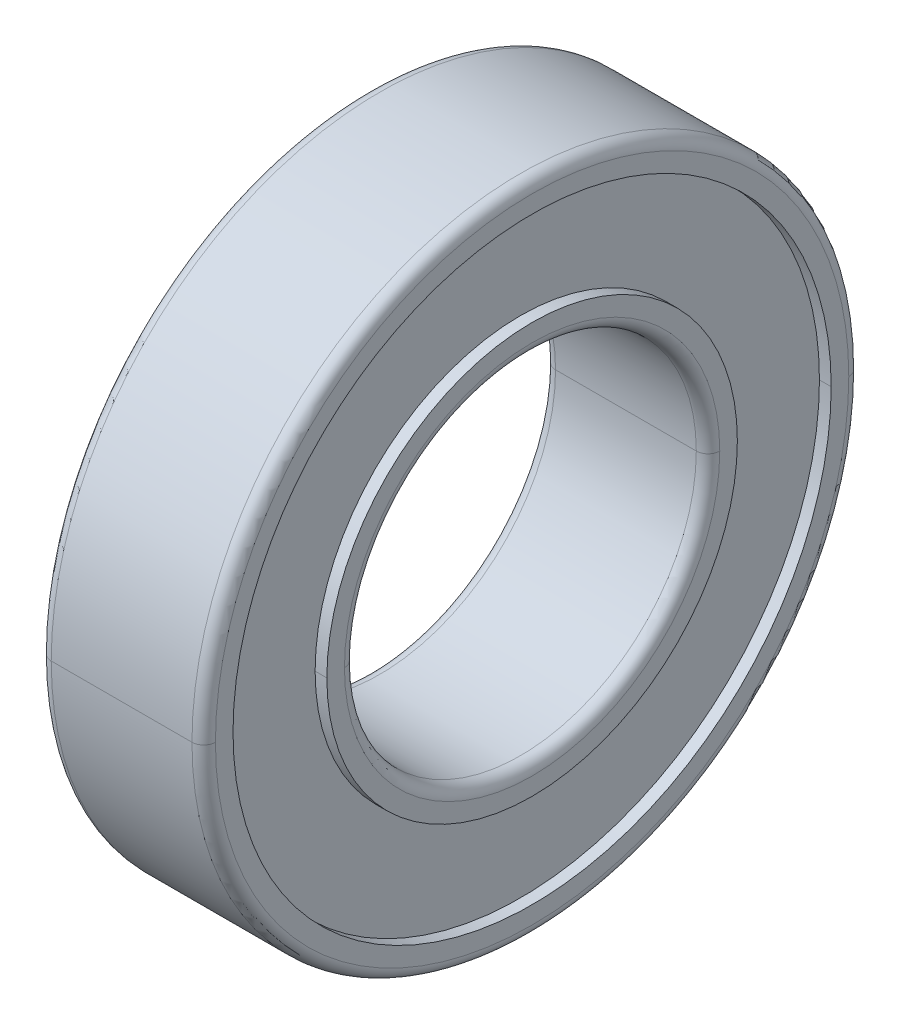
ISO-10303-21;
HEADER;
FILE_DESCRIPTION(('STEP AP214'),'2;1');
FILE_NAME('part.step','',(''),(''),'','','');
FILE_SCHEMA(('AUTOMOTIVE_DESIGN { 1 0 10303 214 1 1 1 1 }'));
ENDSEC;
DATA;
#1=APPLICATION_CONTEXT('core data for automotive mechanical design processes');
#2=APPLICATION_PROTOCOL_DEFINITION('international standard','automotive_design',2000,#1);
#3=PRODUCT_CONTEXT('',#1,'mechanical');
#4=PRODUCT('Part','Part','',(#3));
#5=PRODUCT_RELATED_PRODUCT_CATEGORY('part','',(#4));
#6=PRODUCT_DEFINITION_FORMATION('','',#4);
#7=PRODUCT_DEFINITION_CONTEXT('part definition',#1,'design');
#8=PRODUCT_DEFINITION('design','',#6,#7);
#9=PRODUCT_DEFINITION_SHAPE('','',#8);
#10=(LENGTH_UNIT() NAMED_UNIT(*) SI_UNIT(.MILLI.,.METRE.));
#11=(NAMED_UNIT(*) PLANE_ANGLE_UNIT() SI_UNIT($,.RADIAN.));
#12=(NAMED_UNIT(*) SI_UNIT($,.STERADIAN.) SOLID_ANGLE_UNIT());
#13=UNCERTAINTY_MEASURE_WITH_UNIT(LENGTH_MEASURE(1.E-05),#10,'distance_accuracy_value','');
#14=(GEOMETRIC_REPRESENTATION_CONTEXT(3) GLOBAL_UNCERTAINTY_ASSIGNED_CONTEXT((#13)) GLOBAL_UNIT_ASSIGNED_CONTEXT((#10,
#11,#12)) REPRESENTATION_CONTEXT('',''));
#15=CARTESIAN_POINT('',(0.,0.,0.));
#16=DIRECTION('',(0.,0.,1.));
#17=DIRECTION('',(1.,0.,0.));
#18=AXIS2_PLACEMENT_3D('',#15,#16,#17);
#19=CARTESIAN_POINT('',(0.5,0.,0.));
#20=DIRECTION('',(1.,0.,0.));
#21=DIRECTION('',(0.,0.,-1.));
#22=AXIS2_PLACEMENT_3D('',#19,#20,#21);
#23=TOROIDAL_SURFACE('',#22,13.5,0.5);
#24=CARTESIAN_POINT('',(0.5,0.,13.5));
#25=DIRECTION('',(0.,1.,0.));
#26=DIRECTION('',(0.,0.,1.));
#27=AXIS2_PLACEMENT_3D('',#24,#25,#26);
#28=CIRCLE('',#27,0.5);
#29=CARTESIAN_POINT('',(0.,0.,13.5));
#30=VERTEX_POINT('',#29);
#31=CARTESIAN_POINT('',(0.5,0.,14.));
#32=VERTEX_POINT('',#31);
#33=EDGE_CURVE('E293',#30,#32,#28,.T.);
#34=ORIENTED_EDGE('',*,*,#33,.F.);
#35=CARTESIAN_POINT('',(0.,0.,0.));
#36=DIRECTION('',(-1.,0.,0.));
#37=DIRECTION('',(0.,0.,-1.));
#38=AXIS2_PLACEMENT_3D('',#35,#36,#37);
#39=CIRCLE('',#38,13.5);
#40=CARTESIAN_POINT('',(0.,0.,-13.5));
#41=VERTEX_POINT('',#40);
#42=EDGE_CURVE('E234',#41,#30,#39,.T.);
#43=ORIENTED_EDGE('',*,*,#42,.F.);
#44=CARTESIAN_POINT('',(0.5,0.,-13.5));
#45=DIRECTION('',(0.,-1.,0.));
#46=DIRECTION('',(0.,0.,-1.));
#47=AXIS2_PLACEMENT_3D('',#44,#45,#46);
#48=CIRCLE('',#47,0.5);
#49=CARTESIAN_POINT('',(0.5,0.,-14.));
#50=VERTEX_POINT('',#49);
#51=EDGE_CURVE('E189',#41,#50,#48,.T.);
#52=ORIENTED_EDGE('',*,*,#51,.T.);
#53=CARTESIAN_POINT('',(0.5,0.,0.));
#54=DIRECTION('',(1.,0.,0.));
#55=DIRECTION('',(0.,0.,-1.));
#56=AXIS2_PLACEMENT_3D('',#53,#54,#55);
#57=CIRCLE('',#56,14.);
#58=EDGE_CURVE('E231',#32,#50,#57,.T.);
#59=ORIENTED_EDGE('',*,*,#58,.F.);
#60=EDGE_LOOP('',(#34,#43,#52,#59));
#61=FACE_BOUND('',#60,.T.);
#62=ADVANCED_FACE('F16',(#61),#23,.T.);
#63=CARTESIAN_POINT('',(6.5,0.,0.));
#64=DIRECTION('',(-1.,0.,0.));
#65=DIRECTION('',(0.,0.,1.));
#66=AXIS2_PLACEMENT_3D('',#63,#64,#65);
#67=TOROIDAL_SURFACE('',#66,13.5,0.5);
#68=CARTESIAN_POINT('',(6.5,0.,-13.5));
#69=DIRECTION('',(0.,1.,0.));
#70=DIRECTION('',(0.,0.,1.));
#71=AXIS2_PLACEMENT_3D('',#68,#69,#70);
#72=CIRCLE('',#71,0.5);
#73=CARTESIAN_POINT('',(7.,0.,-13.5));
#74=VERTEX_POINT('',#73);
#75=CARTESIAN_POINT('',(6.5,0.,-14.));
#76=VERTEX_POINT('',#75);
#77=EDGE_CURVE('E177',#74,#76,#72,.T.);
#78=ORIENTED_EDGE('',*,*,#77,.F.);
#79=CARTESIAN_POINT('',(7.,0.,0.));
#80=DIRECTION('',(1.,0.,0.));
#81=DIRECTION('',(0.,0.,1.));
#82=AXIS2_PLACEMENT_3D('',#79,#80,#81);
#83=CIRCLE('',#82,13.5);
#84=CARTESIAN_POINT('',(7.,0.,13.5));
#85=VERTEX_POINT('',#84);
#86=EDGE_CURVE('E164',#85,#74,#83,.T.);
#87=ORIENTED_EDGE('',*,*,#86,.F.);
#88=CARTESIAN_POINT('',(6.5,0.,13.5));
#89=DIRECTION('',(0.,-1.,0.));
#90=DIRECTION('',(0.,0.,-1.));
#91=AXIS2_PLACEMENT_3D('',#88,#89,#90);
#92=CIRCLE('',#91,0.5);
#93=CARTESIAN_POINT('',(6.5,0.,14.));
#94=VERTEX_POINT('',#93);
#95=EDGE_CURVE('E187',#85,#94,#92,.T.);
#96=ORIENTED_EDGE('',*,*,#95,.T.);
#97=CARTESIAN_POINT('',(6.5,0.,0.));
#98=DIRECTION('',(-1.,0.,0.));
#99=DIRECTION('',(0.,0.,1.));
#100=AXIS2_PLACEMENT_3D('',#97,#98,#99);
#101=CIRCLE('',#100,14.);
#102=EDGE_CURVE('E173',#76,#94,#101,.T.);
#103=ORIENTED_EDGE('',*,*,#102,.F.);
#104=EDGE_LOOP('',(#78,#87,#96,#103));
#105=FACE_BOUND('',#104,.T.);
#106=ADVANCED_FACE('F178',(#105),#67,.T.);
#107=CARTESIAN_POINT('',(0.5,0.,0.));
#108=DIRECTION('',(1.,0.,0.));
#109=DIRECTION('',(0.,0.,-1.));
#110=AXIS2_PLACEMENT_3D('',#107,#108,#109);
#111=TOROIDAL_SURFACE('',#110,8.,0.5);
#112=CARTESIAN_POINT('',(0.5,0.,8.));
#113=DIRECTION('',(0.,1.,0.));
#114=DIRECTION('',(0.,0.,1.));
#115=AXIS2_PLACEMENT_3D('',#112,#113,#114);
#116=CIRCLE('',#115,0.5);
#117=CARTESIAN_POINT('',(0.5,0.,7.5));
#118=VERTEX_POINT('',#117);
#119=CARTESIAN_POINT('',(0.,0.,8.));
#120=VERTEX_POINT('',#119);
#121=EDGE_CURVE('E283',#118,#120,#116,.T.);
#122=ORIENTED_EDGE('',*,*,#121,.F.);
#123=CARTESIAN_POINT('',(0.5,0.,0.));
#124=DIRECTION('',(-1.,0.,0.));
#125=DIRECTION('',(0.,0.,-1.));
#126=AXIS2_PLACEMENT_3D('',#123,#124,#125);
#127=CIRCLE('',#126,7.5);
#128=CARTESIAN_POINT('',(0.5,0.,-7.5));
#129=VERTEX_POINT('',#128);
#130=EDGE_CURVE('E300',#129,#118,#127,.T.);
#131=ORIENTED_EDGE('',*,*,#130,.F.);
#132=CARTESIAN_POINT('',(0.5,0.,-8.));
#133=DIRECTION('',(0.,-1.,0.));
#134=DIRECTION('',(0.,0.,-1.));
#135=AXIS2_PLACEMENT_3D('',#132,#133,#134);
#136=CIRCLE('',#135,0.5);
#137=CARTESIAN_POINT('',(0.,0.,-8.));
#138=VERTEX_POINT('',#137);
#139=EDGE_CURVE('E310',#129,#138,#136,.T.);
#140=ORIENTED_EDGE('',*,*,#139,.T.);
#141=CARTESIAN_POINT('',(0.,0.,0.));
#142=DIRECTION('',(1.,0.,0.));
#143=DIRECTION('',(0.,0.,-1.));
#144=AXIS2_PLACEMENT_3D('',#141,#142,#143);
#145=CIRCLE('',#144,8.);
#146=EDGE_CURVE('E235',#120,#138,#145,.T.);
#147=ORIENTED_EDGE('',*,*,#146,.F.);
#148=EDGE_LOOP('',(#122,#131,#140,#147));
#149=FACE_BOUND('',#148,.T.);
#150=ADVANCED_FACE('F688',(#149),#111,.T.);
#151=CARTESIAN_POINT('',(6.5,0.,0.));
#152=DIRECTION('',(-1.,0.,0.));
#153=DIRECTION('',(0.,0.,1.));
#154=AXIS2_PLACEMENT_3D('',#151,#152,#153);
#155=TOROIDAL_SURFACE('',#154,8.,0.5);
#156=CARTESIAN_POINT('',(6.5,0.,-8.));
#157=DIRECTION('',(0.,1.,0.));
#158=DIRECTION('',(0.,0.,1.));
#159=AXIS2_PLACEMENT_3D('',#156,#157,#158);
#160=CIRCLE('',#159,0.5);
#161=CARTESIAN_POINT('',(6.5,0.,-7.5));
#162=VERTEX_POINT('',#161);
#163=CARTESIAN_POINT('',(7.,0.,-8.));
#164=VERTEX_POINT('',#163);
#165=EDGE_CURVE('E309',#162,#164,#160,.T.);
#166=ORIENTED_EDGE('',*,*,#165,.F.);
#167=CARTESIAN_POINT('',(6.5,0.,0.));
#168=DIRECTION('',(1.,0.,0.));
#169=DIRECTION('',(0.,0.,1.));
#170=AXIS2_PLACEMENT_3D('',#167,#168,#169);
#171=CIRCLE('',#170,7.5);
#172=CARTESIAN_POINT('',(6.5,0.,7.5));
#173=VERTEX_POINT('',#172);
#174=EDGE_CURVE('E220',#173,#162,#171,.T.);
#175=ORIENTED_EDGE('',*,*,#174,.F.);
#176=CARTESIAN_POINT('',(6.5,0.,8.));
#177=DIRECTION('',(0.,-1.,0.));
#178=DIRECTION('',(0.,0.,-1.));
#179=AXIS2_PLACEMENT_3D('',#176,#177,#178);
#180=CIRCLE('',#179,0.5);
#181=CARTESIAN_POINT('',(7.,0.,8.));
#182=VERTEX_POINT('',#181);
#183=EDGE_CURVE('E201',#173,#182,#180,.T.);
#184=ORIENTED_EDGE('',*,*,#183,.T.);
#185=CARTESIAN_POINT('',(7.,0.,0.));
#186=DIRECTION('',(-1.,0.,0.));
#187=DIRECTION('',(0.,0.,1.));
#188=AXIS2_PLACEMENT_3D('',#185,#186,#187);
#189=CIRCLE('',#188,8.);
#190=EDGE_CURVE('E104',#164,#182,#189,.T.);
#191=ORIENTED_EDGE('',*,*,#190,.F.);
#192=EDGE_LOOP('',(#166,#175,#184,#191));
#193=FACE_BOUND('',#192,.T.);
#194=ADVANCED_FACE('F684',(#193),#155,.T.);
#195=CARTESIAN_POINT('',(0.,0.,0.));
#196=DIRECTION('',(-1.,0.,0.));
#197=DIRECTION('',(0.,0.,1.));
#198=AXIS2_PLACEMENT_3D('',#195,#196,#197);
#199=CYLINDRICAL_SURFACE('',#198,8.75);
#200=DIRECTION('',(-1.,0.,0.));
#201=VECTOR('',#200,1.);
#202=CARTESIAN_POINT('',(0.,0.,-8.75));
#203=LINE('',#202,#201);
#204=CARTESIAN_POINT('',(0.5,0.,-8.75));
#205=VERTEX_POINT('',#204);
#206=CARTESIAN_POINT('',(0.,0.,-8.75));
#207=VERTEX_POINT('',#206);
#208=EDGE_CURVE('E240',#205,#207,#203,.T.);
#209=ORIENTED_EDGE('',*,*,#208,.F.);
#210=CARTESIAN_POINT('',(0.5,0.,0.));
#211=DIRECTION('',(-1.,0.,0.));
#212=DIRECTION('',(0.,0.,1.));
#213=AXIS2_PLACEMENT_3D('',#210,#211,#212);
#214=CIRCLE('',#213,8.75);
#215=CARTESIAN_POINT('',(0.5,0.,8.75));
#216=VERTEX_POINT('',#215);
#217=EDGE_CURVE('E11',#205,#216,#214,.T.);
#218=ORIENTED_EDGE('',*,*,#217,.T.);
#219=DIRECTION('',(-1.,0.,0.));
#220=VECTOR('',#219,1.);
#221=CARTESIAN_POINT('',(0.,0.,8.75));
#222=LINE('',#221,#220);
#223=CARTESIAN_POINT('',(0.,0.,8.75));
#224=VERTEX_POINT('',#223);
#225=EDGE_CURVE('E229',#216,#224,#222,.T.);
#226=ORIENTED_EDGE('',*,*,#225,.T.);
#227=CARTESIAN_POINT('',(0.,0.,0.));
#228=DIRECTION('',(-1.,0.,0.));
#229=DIRECTION('',(0.,0.,1.));
#230=AXIS2_PLACEMENT_3D('',#227,#228,#229);
#231=CIRCLE('',#230,8.75);
#232=EDGE_CURVE('E239',#207,#224,#231,.T.);
#233=ORIENTED_EDGE('',*,*,#232,.F.);
#234=EDGE_LOOP('',(#209,#218,#226,#233));
#235=FACE_BOUND('',#234,.T.);
#236=ADVANCED_FACE('F615',(#235),#199,.T.);
#237=CARTESIAN_POINT('',(0.5,12.75,0.));
#238=DIRECTION('',(1.,0.,0.));
#239=DIRECTION('',(0.,1.,0.));
#240=AXIS2_PLACEMENT_3D('',#237,#238,#239);
#241=PLANE('',#240);
#242=CARTESIAN_POINT('',(0.5,0.,0.));
#243=DIRECTION('',(-1.,0.,0.));
#244=DIRECTION('',(0.,0.,1.));
#245=AXIS2_PLACEMENT_3D('',#242,#243,#244);
#246=CIRCLE('',#245,8.75);
#247=EDGE_CURVE('E204',#216,#205,#246,.T.);
#248=ORIENTED_EDGE('',*,*,#247,.F.);
#249=ORIENTED_EDGE('',*,*,#217,.F.);
#250=EDGE_LOOP('',(#248,#249));
#251=FACE_BOUND('',#250,.T.);
#252=CARTESIAN_POINT('',(0.5,0.,0.));
#253=DIRECTION('',(-1.,0.,0.));
#254=DIRECTION('',(0.,0.,1.));
#255=AXIS2_PLACEMENT_3D('',#252,#253,#254);
#256=CIRCLE('',#255,12.75);
#257=CARTESIAN_POINT('',(0.5,0.,12.75));
#258=VERTEX_POINT('',#257);
#259=CARTESIAN_POINT('',(0.5,0.,-12.75));
#260=VERTEX_POINT('',#259);
#261=EDGE_CURVE('E27',#258,#260,#256,.T.);
#262=ORIENTED_EDGE('',*,*,#261,.T.);
#263=CARTESIAN_POINT('',(0.5,0.,0.));
#264=DIRECTION('',(-1.,0.,0.));
#265=DIRECTION('',(0.,0.,1.));
#266=AXIS2_PLACEMENT_3D('',#263,#264,#265);
#267=CIRCLE('',#266,12.75);
#268=EDGE_CURVE('E225',#260,#258,#267,.T.);
#269=ORIENTED_EDGE('',*,*,#268,.T.);
#270=EDGE_LOOP('',(#262,#269));
#271=FACE_BOUND('',#270,.T.);
#272=ADVANCED_FACE('F610',(#251,#271),#241,.F.);
#273=CARTESIAN_POINT('',(0.,0.,0.));
#274=DIRECTION('',(-1.,0.,0.));
#275=DIRECTION('',(0.,0.,1.));
#276=AXIS2_PLACEMENT_3D('',#273,#274,#275);
#277=CYLINDRICAL_SURFACE('',#276,12.75);
#278=DIRECTION('',(-1.,0.,0.));
#279=VECTOR('',#278,1.);
#280=CARTESIAN_POINT('',(0.,0.,-12.75));
#281=LINE('',#280,#279);
#282=CARTESIAN_POINT('',(0.,0.,-12.75));
#283=VERTEX_POINT('',#282);
#284=EDGE_CURVE('E228',#260,#283,#281,.T.);
#285=ORIENTED_EDGE('',*,*,#284,.F.);
#286=ORIENTED_EDGE('',*,*,#261,.F.);
#287=DIRECTION('',(-1.,0.,0.));
#288=VECTOR('',#287,1.);
#289=CARTESIAN_POINT('',(0.,0.,12.75));
#290=LINE('',#289,#288);
#291=CARTESIAN_POINT('',(0.,0.,12.75));
#292=VERTEX_POINT('',#291);
#293=EDGE_CURVE('E255',#258,#292,#290,.T.);
#294=ORIENTED_EDGE('',*,*,#293,.T.);
#295=CARTESIAN_POINT('',(0.,0.,0.));
#296=DIRECTION('',(-1.,0.,0.));
#297=DIRECTION('',(0.,0.,1.));
#298=AXIS2_PLACEMENT_3D('',#295,#296,#297);
#299=CIRCLE('',#298,12.75);
#300=EDGE_CURVE('E268',#292,#283,#299,.T.);
#301=ORIENTED_EDGE('',*,*,#300,.T.);
#302=EDGE_LOOP('',(#285,#286,#294,#301));
#303=FACE_BOUND('',#302,.T.);
#304=ADVANCED_FACE('F614',(#303),#277,.F.);
#305=CARTESIAN_POINT('',(0.,14.,0.));
#306=DIRECTION('',(1.,0.,0.));
#307=DIRECTION('',(0.,1.,0.));
#308=AXIS2_PLACEMENT_3D('',#305,#306,#307);
#309=PLANE('',#308);
#310=ORIENTED_EDGE('',*,*,#300,.F.);
#311=CARTESIAN_POINT('',(0.,0.,0.));
#312=DIRECTION('',(-1.,0.,0.));
#313=DIRECTION('',(0.,0.,1.));
#314=AXIS2_PLACEMENT_3D('',#311,#312,#313);
#315=CIRCLE('',#314,12.75);
#316=EDGE_CURVE('E259',#283,#292,#315,.T.);
#317=ORIENTED_EDGE('',*,*,#316,.F.);
#318=EDGE_LOOP('',(#310,#317));
#319=FACE_BOUND('',#318,.T.);
#320=ORIENTED_EDGE('',*,*,#42,.T.);
#321=CARTESIAN_POINT('',(0.,0.,0.));
#322=DIRECTION('',(-1.,0.,0.));
#323=DIRECTION('',(0.,0.,-1.));
#324=AXIS2_PLACEMENT_3D('',#321,#322,#323);
#325=CIRCLE('',#324,13.5);
#326=EDGE_CURVE('E289',#30,#41,#325,.T.);
#327=ORIENTED_EDGE('',*,*,#326,.T.);
#328=EDGE_LOOP('',(#320,#327));
#329=FACE_BOUND('',#328,.T.);
#330=ADVANCED_FACE('F652',(#319,#329),#309,.F.);
#331=CARTESIAN_POINT('',(0.,0.,0.));
#332=DIRECTION('',(-1.,0.,0.));
#333=DIRECTION('',(0.,0.,1.));
#334=AXIS2_PLACEMENT_3D('',#331,#332,#333);
#335=CYLINDRICAL_SURFACE('',#334,14.);
#336=DIRECTION('',(-1.,0.,0.));
#337=VECTOR('',#336,1.);
#338=CARTESIAN_POINT('',(0.,0.,-14.));
#339=LINE('',#338,#337);
#340=EDGE_CURVE('E20',#76,#50,#339,.T.);
#341=ORIENTED_EDGE('',*,*,#340,.F.);
#342=ORIENTED_EDGE('',*,*,#102,.T.);
#343=DIRECTION('',(-1.,0.,0.));
#344=VECTOR('',#343,1.);
#345=CARTESIAN_POINT('',(0.,0.,14.));
#346=LINE('',#345,#344);
#347=EDGE_CURVE('E272',#94,#32,#346,.T.);
#348=ORIENTED_EDGE('',*,*,#347,.T.);
#349=ORIENTED_EDGE('',*,*,#58,.T.);
#350=EDGE_LOOP('',(#341,#342,#348,#349));
#351=FACE_BOUND('',#350,.T.);
#352=ADVANCED_FACE('F350',(#351),#335,.T.);
#353=CARTESIAN_POINT('',(7.,12.75,0.));
#354=DIRECTION('',(-1.,0.,0.));
#355=DIRECTION('',(0.,0.,1.));
#356=AXIS2_PLACEMENT_3D('',#353,#354,#355);
#357=PLANE('',#356);
#358=CARTESIAN_POINT('',(7.,0.,0.));
#359=DIRECTION('',(-1.,0.,0.));
#360=DIRECTION('',(0.,0.,1.));
#361=AXIS2_PLACEMENT_3D('',#358,#359,#360);
#362=CIRCLE('',#361,12.75);
#363=CARTESIAN_POINT('',(7.,0.,12.75));
#364=VERTEX_POINT('',#363);
#365=CARTESIAN_POINT('',(7.,0.,-12.75));
#366=VERTEX_POINT('',#365);
#367=EDGE_CURVE('E174',#364,#366,#362,.T.);
#368=ORIENTED_EDGE('',*,*,#367,.T.);
#369=CARTESIAN_POINT('',(7.,0.,0.));
#370=DIRECTION('',(-1.,0.,0.));
#371=DIRECTION('',(0.,0.,1.));
#372=AXIS2_PLACEMENT_3D('',#369,#370,#371);
#373=CIRCLE('',#372,12.75);
#374=EDGE_CURVE('E276',#366,#364,#373,.T.);
#375=ORIENTED_EDGE('',*,*,#374,.T.);
#376=EDGE_LOOP('',(#368,#375));
#377=FACE_BOUND('',#376,.T.);
#378=ORIENTED_EDGE('',*,*,#86,.T.);
#379=CARTESIAN_POINT('',(7.,0.,0.));
#380=DIRECTION('',(1.,0.,0.));
#381=DIRECTION('',(0.,0.,1.));
#382=AXIS2_PLACEMENT_3D('',#379,#380,#381);
#383=CIRCLE('',#382,13.5);
#384=EDGE_CURVE('E168',#74,#85,#383,.T.);
#385=ORIENTED_EDGE('',*,*,#384,.T.);
#386=EDGE_LOOP('',(#378,#385));
#387=FACE_BOUND('',#386,.T.);
#388=ADVANCED_FACE('F166',(#377,#387),#357,.F.);
#389=CARTESIAN_POINT('',(0.,0.,0.));
#390=DIRECTION('',(-1.,0.,0.));
#391=DIRECTION('',(0.,0.,1.));
#392=AXIS2_PLACEMENT_3D('',#389,#390,#391);
#393=CYLINDRICAL_SURFACE('',#392,12.75);
#394=DIRECTION('',(-1.,0.,0.));
#395=VECTOR('',#394,1.);
#396=CARTESIAN_POINT('',(0.,0.,-12.75));
#397=LINE('',#396,#395);
#398=CARTESIAN_POINT('',(6.5,0.,-12.75));
#399=VERTEX_POINT('',#398);
#400=EDGE_CURVE('E215',#366,#399,#397,.T.);
#401=ORIENTED_EDGE('',*,*,#400,.F.);
#402=ORIENTED_EDGE('',*,*,#367,.F.);
#403=DIRECTION('',(-1.,0.,0.));
#404=VECTOR('',#403,1.);
#405=CARTESIAN_POINT('',(0.,0.,12.75));
#406=LINE('',#405,#404);
#407=CARTESIAN_POINT('',(6.5,0.,12.75));
#408=VERTEX_POINT('',#407);
#409=EDGE_CURVE('E214',#364,#408,#406,.T.);
#410=ORIENTED_EDGE('',*,*,#409,.T.);
#411=CARTESIAN_POINT('',(6.5,0.,0.));
#412=DIRECTION('',(-1.,0.,0.));
#413=DIRECTION('',(0.,0.,1.));
#414=AXIS2_PLACEMENT_3D('',#411,#412,#413);
#415=CIRCLE('',#414,12.75);
#416=EDGE_CURVE('E208',#408,#399,#415,.T.);
#417=ORIENTED_EDGE('',*,*,#416,.T.);
#418=EDGE_LOOP('',(#401,#402,#410,#417));
#419=FACE_BOUND('',#418,.T.);
#420=ADVANCED_FACE('F750',(#419),#393,.F.);
#421=CARTESIAN_POINT('',(6.5,8.75,0.));
#422=DIRECTION('',(-1.,0.,0.));
#423=DIRECTION('',(0.,0.,1.));
#424=AXIS2_PLACEMENT_3D('',#421,#422,#423);
#425=PLANE('',#424);
#426=CARTESIAN_POINT('',(6.5,0.,0.));
#427=DIRECTION('',(-1.,0.,0.));
#428=DIRECTION('',(0.,0.,1.));
#429=AXIS2_PLACEMENT_3D('',#426,#427,#428);
#430=CIRCLE('',#429,8.75);
#431=CARTESIAN_POINT('',(6.5,0.,8.75));
#432=VERTEX_POINT('',#431);
#433=CARTESIAN_POINT('',(6.5,0.,-8.75));
#434=VERTEX_POINT('',#433);
#435=EDGE_CURVE('E221',#432,#434,#430,.T.);
#436=ORIENTED_EDGE('',*,*,#435,.T.);
#437=CARTESIAN_POINT('',(6.5,0.,0.));
#438=DIRECTION('',(-1.,0.,0.));
#439=DIRECTION('',(0.,0.,1.));
#440=AXIS2_PLACEMENT_3D('',#437,#438,#439);
#441=CIRCLE('',#440,8.75);
#442=EDGE_CURVE('E41',#434,#432,#441,.T.);
#443=ORIENTED_EDGE('',*,*,#442,.T.);
#444=EDGE_LOOP('',(#436,#443));
#445=FACE_BOUND('',#444,.T.);
#446=ORIENTED_EDGE('',*,*,#416,.F.);
#447=CARTESIAN_POINT('',(6.5,0.,0.));
#448=DIRECTION('',(-1.,0.,0.));
#449=DIRECTION('',(0.,0.,1.));
#450=AXIS2_PLACEMENT_3D('',#447,#448,#449);
#451=CIRCLE('',#450,12.75);
#452=EDGE_CURVE('E211',#399,#408,#451,.T.);
#453=ORIENTED_EDGE('',*,*,#452,.F.);
#454=EDGE_LOOP('',(#446,#453));
#455=FACE_BOUND('',#454,.T.);
#456=ADVANCED_FACE('F18',(#445,#455),#425,.F.);
#457=CARTESIAN_POINT('',(0.,0.,0.));
#458=DIRECTION('',(-1.,0.,0.));
#459=DIRECTION('',(0.,0.,1.));
#460=AXIS2_PLACEMENT_3D('',#457,#458,#459);
#461=CYLINDRICAL_SURFACE('',#460,8.75);
#462=DIRECTION('',(-1.,0.,0.));
#463=VECTOR('',#462,1.);
#464=CARTESIAN_POINT('',(0.,0.,-8.75));
#465=LINE('',#464,#463);
#466=CARTESIAN_POINT('',(7.,0.,-8.75));
#467=VERTEX_POINT('',#466);
#468=EDGE_CURVE('E249',#467,#434,#465,.T.);
#469=ORIENTED_EDGE('',*,*,#468,.F.);
#470=CARTESIAN_POINT('',(7.,0.,0.));
#471=DIRECTION('',(-1.,0.,0.));
#472=DIRECTION('',(0.,0.,1.));
#473=AXIS2_PLACEMENT_3D('',#470,#471,#472);
#474=CIRCLE('',#473,8.75);
#475=CARTESIAN_POINT('',(7.,0.,8.75));
#476=VERTEX_POINT('',#475);
#477=EDGE_CURVE('E238',#467,#476,#474,.T.);
#478=ORIENTED_EDGE('',*,*,#477,.T.);
#479=DIRECTION('',(-1.,0.,0.));
#480=VECTOR('',#479,1.);
#481=CARTESIAN_POINT('',(0.,0.,8.75));
#482=LINE('',#481,#480);
#483=EDGE_CURVE('E217',#476,#432,#482,.T.);
#484=ORIENTED_EDGE('',*,*,#483,.T.);
#485=ORIENTED_EDGE('',*,*,#442,.F.);
#486=EDGE_LOOP('',(#469,#478,#484,#485));
#487=FACE_BOUND('',#486,.T.);
#488=ADVANCED_FACE('F670',(#487),#461,.T.);
#489=CARTESIAN_POINT('',(7.,7.5,0.));
#490=DIRECTION('',(-1.,0.,0.));
#491=DIRECTION('',(0.,0.,1.));
#492=AXIS2_PLACEMENT_3D('',#489,#490,#491);
#493=PLANE('',#492);
#494=CARTESIAN_POINT('',(7.,0.,0.));
#495=DIRECTION('',(-1.,0.,0.));
#496=DIRECTION('',(0.,0.,1.));
#497=AXIS2_PLACEMENT_3D('',#494,#495,#496);
#498=CIRCLE('',#497,8.);
#499=EDGE_CURVE('E205',#182,#164,#498,.T.);
#500=ORIENTED_EDGE('',*,*,#499,.T.);
#501=ORIENTED_EDGE('',*,*,#190,.T.);
#502=EDGE_LOOP('',(#500,#501));
#503=FACE_BOUND('',#502,.T.);
#504=CARTESIAN_POINT('',(7.,0.,0.));
#505=DIRECTION('',(-1.,0.,0.));
#506=DIRECTION('',(0.,0.,1.));
#507=AXIS2_PLACEMENT_3D('',#504,#505,#506);
#508=CIRCLE('',#507,8.75);
#509=EDGE_CURVE('E245',#476,#467,#508,.T.);
#510=ORIENTED_EDGE('',*,*,#509,.F.);
#511=ORIENTED_EDGE('',*,*,#477,.F.);
#512=EDGE_LOOP('',(#510,#511));
#513=FACE_BOUND('',#512,.T.);
#514=ADVANCED_FACE('F665',(#503,#513),#493,.F.);
#515=CARTESIAN_POINT('',(0.,0.,0.));
#516=DIRECTION('',(-1.,0.,0.));
#517=DIRECTION('',(0.,0.,1.));
#518=AXIS2_PLACEMENT_3D('',#515,#516,#517);
#519=CYLINDRICAL_SURFACE('',#518,7.5);
#520=DIRECTION('',(-1.,0.,0.));
#521=VECTOR('',#520,1.);
#522=CARTESIAN_POINT('',(0.,0.,-7.5));
#523=LINE('',#522,#521);
#524=EDGE_CURVE('E224',#162,#129,#523,.T.);
#525=ORIENTED_EDGE('',*,*,#524,.F.);
#526=CARTESIAN_POINT('',(6.5,0.,0.));
#527=DIRECTION('',(1.,0.,0.));
#528=DIRECTION('',(0.,0.,1.));
#529=AXIS2_PLACEMENT_3D('',#526,#527,#528);
#530=CIRCLE('',#529,7.5);
#531=EDGE_CURVE('E306',#162,#173,#530,.T.);
#532=ORIENTED_EDGE('',*,*,#531,.T.);
#533=DIRECTION('',(-1.,0.,0.));
#534=VECTOR('',#533,1.);
#535=CARTESIAN_POINT('',(0.,0.,7.5));
#536=LINE('',#535,#534);
#537=EDGE_CURVE('E119',#173,#118,#536,.T.);
#538=ORIENTED_EDGE('',*,*,#537,.T.);
#539=CARTESIAN_POINT('',(0.5,0.,0.));
#540=DIRECTION('',(-1.,0.,0.));
#541=DIRECTION('',(0.,0.,-1.));
#542=AXIS2_PLACEMENT_3D('',#539,#540,#541);
#543=CIRCLE('',#542,7.5);
#544=EDGE_CURVE('E288',#118,#129,#543,.T.);
#545=ORIENTED_EDGE('',*,*,#544,.T.);
#546=EDGE_LOOP('',(#525,#532,#538,#545));
#547=FACE_BOUND('',#546,.T.);
#548=ADVANCED_FACE('F669',(#547),#519,.F.);
#549=CARTESIAN_POINT('',(0.,8.75,0.));
#550=DIRECTION('',(1.,0.,0.));
#551=DIRECTION('',(0.,1.,0.));
#552=AXIS2_PLACEMENT_3D('',#549,#550,#551);
#553=PLANE('',#552);
#554=CARTESIAN_POINT('',(0.,0.,0.));
#555=DIRECTION('',(1.,0.,0.));
#556=DIRECTION('',(0.,0.,-1.));
#557=AXIS2_PLACEMENT_3D('',#554,#555,#556);
#558=CIRCLE('',#557,8.);
#559=EDGE_CURVE('E287',#138,#120,#558,.T.);
#560=ORIENTED_EDGE('',*,*,#559,.T.);
#561=ORIENTED_EDGE('',*,*,#146,.T.);
#562=EDGE_LOOP('',(#560,#561));
#563=FACE_BOUND('',#562,.T.);
#564=CARTESIAN_POINT('',(0.,0.,0.));
#565=DIRECTION('',(-1.,0.,0.));
#566=DIRECTION('',(0.,0.,1.));
#567=AXIS2_PLACEMENT_3D('',#564,#565,#566);
#568=CIRCLE('',#567,8.75);
#569=EDGE_CURVE('E244',#224,#207,#568,.T.);
#570=ORIENTED_EDGE('',*,*,#569,.T.);
#571=ORIENTED_EDGE('',*,*,#232,.T.);
#572=EDGE_LOOP('',(#570,#571));
#573=FACE_BOUND('',#572,.T.);
#574=ADVANCED_FACE('F597',(#563,#573),#553,.F.);
#575=CARTESIAN_POINT('',(0.,0.,0.));
#576=DIRECTION('',(-1.,0.,0.));
#577=DIRECTION('',(0.,0.,1.));
#578=AXIS2_PLACEMENT_3D('',#575,#576,#577);
#579=CYLINDRICAL_SURFACE('',#578,7.5);
#580=ORIENTED_EDGE('',*,*,#174,.T.);
#581=ORIENTED_EDGE('',*,*,#524,.T.);
#582=ORIENTED_EDGE('',*,*,#130,.T.);
#583=ORIENTED_EDGE('',*,*,#537,.F.);
#584=EDGE_LOOP('',(#580,#581,#582,#583));
#585=FACE_BOUND('',#584,.T.);
#586=ADVANCED_FACE('F592',(#585),#579,.F.);
#587=CARTESIAN_POINT('',(0.,0.,0.));
#588=DIRECTION('',(-1.,0.,0.));
#589=DIRECTION('',(0.,0.,1.));
#590=AXIS2_PLACEMENT_3D('',#587,#588,#589);
#591=CYLINDRICAL_SURFACE('',#590,8.75);
#592=ORIENTED_EDGE('',*,*,#509,.T.);
#593=ORIENTED_EDGE('',*,*,#468,.T.);
#594=ORIENTED_EDGE('',*,*,#435,.F.);
#595=ORIENTED_EDGE('',*,*,#483,.F.);
#596=EDGE_LOOP('',(#592,#593,#594,#595));
#597=FACE_BOUND('',#596,.T.);
#598=ADVANCED_FACE('F596',(#597),#591,.T.);
#599=CARTESIAN_POINT('',(0.,0.,0.));
#600=DIRECTION('',(-1.,0.,0.));
#601=DIRECTION('',(0.,0.,1.));
#602=AXIS2_PLACEMENT_3D('',#599,#600,#601);
#603=CYLINDRICAL_SURFACE('',#602,12.75);
#604=ORIENTED_EDGE('',*,*,#374,.F.);
#605=ORIENTED_EDGE('',*,*,#400,.T.);
#606=ORIENTED_EDGE('',*,*,#452,.T.);
#607=ORIENTED_EDGE('',*,*,#409,.F.);
#608=EDGE_LOOP('',(#604,#605,#606,#607));
#609=FACE_BOUND('',#608,.T.);
#610=ADVANCED_FACE('F643',(#609),#603,.F.);
#611=CARTESIAN_POINT('',(0.,0.,0.));
#612=DIRECTION('',(-1.,0.,0.));
#613=DIRECTION('',(0.,0.,1.));
#614=AXIS2_PLACEMENT_3D('',#611,#612,#613);
#615=CYLINDRICAL_SURFACE('',#614,14.);
#616=CARTESIAN_POINT('',(6.5,0.,0.));
#617=DIRECTION('',(-1.,0.,0.));
#618=DIRECTION('',(0.,0.,1.));
#619=AXIS2_PLACEMENT_3D('',#616,#617,#618);
#620=CIRCLE('',#619,14.);
#621=EDGE_CURVE('E184',#94,#76,#620,.T.);
#622=ORIENTED_EDGE('',*,*,#621,.T.);
#623=ORIENTED_EDGE('',*,*,#340,.T.);
#624=CARTESIAN_POINT('',(0.5,0.,0.));
#625=DIRECTION('',(1.,0.,0.));
#626=DIRECTION('',(0.,0.,-1.));
#627=AXIS2_PLACEMENT_3D('',#624,#625,#626);
#628=CIRCLE('',#627,14.);
#629=EDGE_CURVE('E196',#50,#32,#628,.T.);
#630=ORIENTED_EDGE('',*,*,#629,.T.);
#631=ORIENTED_EDGE('',*,*,#347,.F.);
#632=EDGE_LOOP('',(#622,#623,#630,#631));
#633=FACE_BOUND('',#632,.T.);
#634=ADVANCED_FACE('F356',(#633),#615,.T.);
#635=CARTESIAN_POINT('',(0.,0.,0.));
#636=DIRECTION('',(-1.,0.,0.));
#637=DIRECTION('',(0.,0.,1.));
#638=AXIS2_PLACEMENT_3D('',#635,#636,#637);
#639=CYLINDRICAL_SURFACE('',#638,12.75);
#640=ORIENTED_EDGE('',*,*,#268,.F.);
#641=ORIENTED_EDGE('',*,*,#284,.T.);
#642=ORIENTED_EDGE('',*,*,#316,.T.);
#643=ORIENTED_EDGE('',*,*,#293,.F.);
#644=EDGE_LOOP('',(#640,#641,#642,#643));
#645=FACE_BOUND('',#644,.T.);
#646=ADVANCED_FACE('F634',(#645),#639,.F.);
#647=CARTESIAN_POINT('',(0.,0.,0.));
#648=DIRECTION('',(-1.,0.,0.));
#649=DIRECTION('',(0.,0.,1.));
#650=AXIS2_PLACEMENT_3D('',#647,#648,#649);
#651=CYLINDRICAL_SURFACE('',#650,8.75);
#652=ORIENTED_EDGE('',*,*,#247,.T.);
#653=ORIENTED_EDGE('',*,*,#208,.T.);
#654=ORIENTED_EDGE('',*,*,#569,.F.);
#655=ORIENTED_EDGE('',*,*,#225,.F.);
#656=EDGE_LOOP('',(#652,#653,#654,#655));
#657=FACE_BOUND('',#656,.T.);
#658=ADVANCED_FACE('F629',(#657),#651,.T.);
#659=CARTESIAN_POINT('',(6.5,0.,0.));
#660=DIRECTION('',(-1.,0.,0.));
#661=DIRECTION('',(0.,0.,1.));
#662=AXIS2_PLACEMENT_3D('',#659,#660,#661);
#663=TOROIDAL_SURFACE('',#662,8.,0.5);
#664=ORIENTED_EDGE('',*,*,#531,.F.);
#665=ORIENTED_EDGE('',*,*,#165,.T.);
#666=ORIENTED_EDGE('',*,*,#499,.F.);
#667=ORIENTED_EDGE('',*,*,#183,.F.);
#668=EDGE_LOOP('',(#664,#665,#666,#667));
#669=FACE_BOUND('',#668,.T.);
#670=ADVANCED_FACE('F633',(#669),#663,.T.);
#671=CARTESIAN_POINT('',(0.5,0.,0.));
#672=DIRECTION('',(1.,0.,0.));
#673=DIRECTION('',(0.,0.,-1.));
#674=AXIS2_PLACEMENT_3D('',#671,#672,#673);
#675=TOROIDAL_SURFACE('',#674,8.,0.5);
#676=ORIENTED_EDGE('',*,*,#544,.F.);
#677=ORIENTED_EDGE('',*,*,#121,.T.);
#678=ORIENTED_EDGE('',*,*,#559,.F.);
#679=ORIENTED_EDGE('',*,*,#139,.F.);
#680=EDGE_LOOP('',(#676,#677,#678,#679));
#681=FACE_BOUND('',#680,.T.);
#682=ADVANCED_FACE('F703',(#681),#675,.T.);
#683=CARTESIAN_POINT('',(6.5,0.,0.));
#684=DIRECTION('',(-1.,0.,0.));
#685=DIRECTION('',(0.,0.,1.));
#686=AXIS2_PLACEMENT_3D('',#683,#684,#685);
#687=TOROIDAL_SURFACE('',#686,13.5,0.5);
#688=ORIENTED_EDGE('',*,*,#384,.F.);
#689=ORIENTED_EDGE('',*,*,#77,.T.);
#690=ORIENTED_EDGE('',*,*,#621,.F.);
#691=ORIENTED_EDGE('',*,*,#95,.F.);
#692=EDGE_LOOP('',(#688,#689,#690,#691));
#693=FACE_BOUND('',#692,.T.);
#694=ADVANCED_FACE('F186',(#693),#687,.T.);
#695=CARTESIAN_POINT('',(0.5,0.,0.));
#696=DIRECTION('',(1.,0.,0.));
#697=DIRECTION('',(0.,0.,-1.));
#698=AXIS2_PLACEMENT_3D('',#695,#696,#697);
#699=TOROIDAL_SURFACE('',#698,13.5,0.5);
#700=ORIENTED_EDGE('',*,*,#326,.F.);
#701=ORIENTED_EDGE('',*,*,#33,.T.);
#702=ORIENTED_EDGE('',*,*,#629,.F.);
#703=ORIENTED_EDGE('',*,*,#51,.F.);
#704=EDGE_LOOP('',(#700,#701,#702,#703));
#705=FACE_BOUND('',#704,.T.);
#706=ADVANCED_FACE('F602',(#705),#699,.T.);
#707=CLOSED_SHELL('',(#62,#106,#150,#194,#236,#272,#304,#330,#352,#388,#420,#456,#488,#514,#548,
#574,#586,#598,#610,#634,#646,#658,#670,#682,#694,#706));
#708=MANIFOLD_SOLID_BREP('B1',#707);
#709=ADVANCED_BREP_SHAPE_REPRESENTATION('',(#18,#708),#14);
#710=SHAPE_DEFINITION_REPRESENTATION(#9,#709);
ENDSEC;
END-ISO-10303-21;
